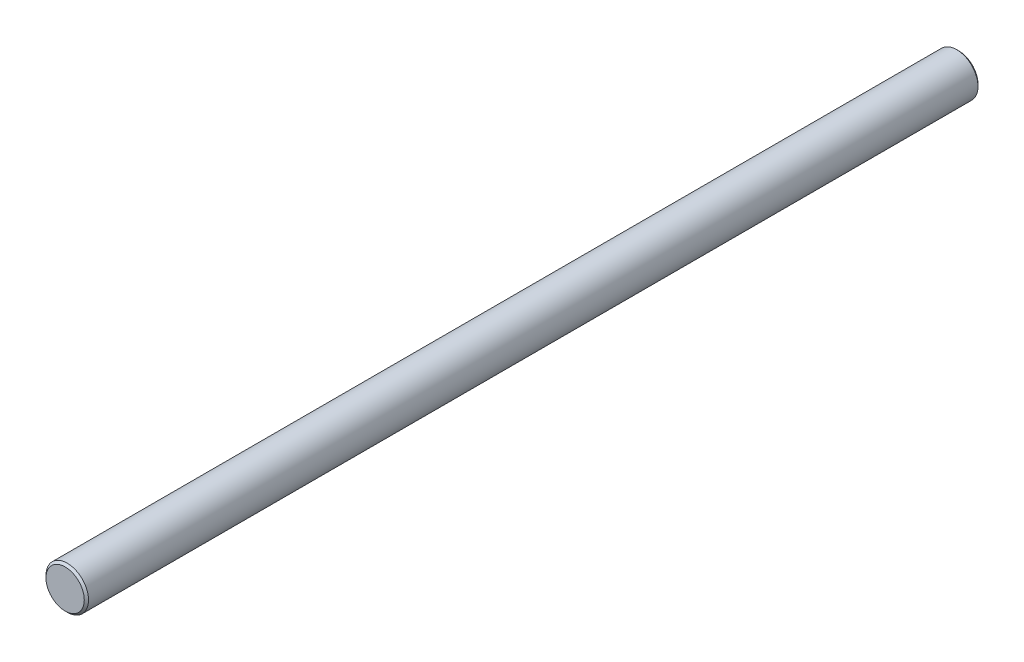
ISO-10303-21;
HEADER;
FILE_DESCRIPTION(('STEP AP214'),'2;1');
FILE_NAME('part.step','',(''),(''),'','','');
FILE_SCHEMA(('AUTOMOTIVE_DESIGN { 1 0 10303 214 1 1 1 1 }'));
ENDSEC;
DATA;
#1=APPLICATION_CONTEXT('core data for automotive mechanical design processes');
#2=APPLICATION_PROTOCOL_DEFINITION('international standard','automotive_design',2000,#1);
#3=PRODUCT_CONTEXT('',#1,'mechanical');
#4=PRODUCT('Part','Part','',(#3));
#5=PRODUCT_RELATED_PRODUCT_CATEGORY('part','',(#4));
#6=PRODUCT_DEFINITION_FORMATION('','',#4);
#7=PRODUCT_DEFINITION_CONTEXT('part definition',#1,'design');
#8=PRODUCT_DEFINITION('design','',#6,#7);
#9=PRODUCT_DEFINITION_SHAPE('','',#8);
#10=(LENGTH_UNIT() NAMED_UNIT(*) SI_UNIT(.MILLI.,.METRE.));
#11=(NAMED_UNIT(*) PLANE_ANGLE_UNIT() SI_UNIT($,.RADIAN.));
#12=(NAMED_UNIT(*) SI_UNIT($,.STERADIAN.) SOLID_ANGLE_UNIT());
#13=UNCERTAINTY_MEASURE_WITH_UNIT(LENGTH_MEASURE(1.E-05),#10,'distance_accuracy_value','');
#14=(GEOMETRIC_REPRESENTATION_CONTEXT(3) GLOBAL_UNCERTAINTY_ASSIGNED_CONTEXT((#13)) GLOBAL_UNIT_ASSIGNED_CONTEXT((#10,
#11,#12)) REPRESENTATION_CONTEXT('',''));
#15=CARTESIAN_POINT('',(0.,0.,0.));
#16=DIRECTION('',(0.,0.,1.));
#17=DIRECTION('',(1.,0.,0.));
#18=AXIS2_PLACEMENT_3D('',#15,#16,#17);
#19=CARTESIAN_POINT('',(0.,0.,-210.));
#20=DIRECTION('',(0.,0.,1.));
#21=DIRECTION('',(1.,0.,0.));
#22=AXIS2_PLACEMENT_3D('',#19,#20,#21);
#23=CYLINDRICAL_SURFACE('',#22,5.);
#24=CARTESIAN_POINT('',(0.,0.,-209.5));
#25=DIRECTION('',(0.,0.,1.));
#26=DIRECTION('',(1.,0.,0.));
#27=AXIS2_PLACEMENT_3D('',#24,#25,#26);
#28=CIRCLE('',#27,5.);
#29=CARTESIAN_POINT('',(5.,0.,-209.5));
#30=VERTEX_POINT('',#29);
#31=EDGE_CURVE('E45',#30,#30,#28,.T.);
#32=ORIENTED_EDGE('',*,*,#31,.T.);
#33=EDGE_LOOP('',(#32));
#34=FACE_BOUND('',#33,.T.);
#35=CARTESIAN_POINT('',(0.,0.,-0.5));
#36=DIRECTION('',(0.,0.,1.));
#37=DIRECTION('',(1.,0.,0.));
#38=AXIS2_PLACEMENT_3D('',#35,#36,#37);
#39=CIRCLE('',#38,5.);
#40=CARTESIAN_POINT('',(5.,0.,-0.5));
#41=VERTEX_POINT('',#40);
#42=EDGE_CURVE('E49',#41,#41,#39,.F.);
#43=ORIENTED_EDGE('',*,*,#42,.T.);
#44=EDGE_LOOP('',(#43));
#45=FACE_BOUND('',#44,.T.);
#46=ADVANCED_FACE('F34',(#34,#45),#23,.T.);
#47=CARTESIAN_POINT('',(0.,0.,-210.));
#48=DIRECTION('',(0.,0.,1.));
#49=DIRECTION('',(1.,0.,0.));
#50=AXIS2_PLACEMENT_3D('',#47,#48,#49);
#51=PLANE('',#50);
#52=CARTESIAN_POINT('',(0.,0.,-210.));
#53=DIRECTION('',(0.,0.,1.));
#54=DIRECTION('',(1.,0.,0.));
#55=AXIS2_PLACEMENT_3D('',#52,#53,#54);
#56=CIRCLE('',#55,4.5);
#57=CARTESIAN_POINT('',(4.5,0.,-210.));
#58=VERTEX_POINT('',#57);
#59=EDGE_CURVE('E41',#58,#58,#56,.F.);
#60=ORIENTED_EDGE('',*,*,#59,.T.);
#61=EDGE_LOOP('',(#60));
#62=FACE_BOUND('',#61,.T.);
#63=ADVANCED_FACE('F65',(#62),#51,.F.);
#64=CARTESIAN_POINT('',(0.,0.,0.));
#65=DIRECTION('',(0.,0.,1.));
#66=DIRECTION('',(1.,0.,0.));
#67=AXIS2_PLACEMENT_3D('',#64,#65,#66);
#68=PLANE('',#67);
#69=CARTESIAN_POINT('',(0.,0.,0.));
#70=DIRECTION('',(0.,0.,1.));
#71=DIRECTION('',(1.,0.,0.));
#72=AXIS2_PLACEMENT_3D('',#69,#70,#71);
#73=CIRCLE('',#72,4.5);
#74=CARTESIAN_POINT('',(4.5,0.,0.));
#75=VERTEX_POINT('',#74);
#76=EDGE_CURVE('E10',#75,#75,#73,.T.);
#77=ORIENTED_EDGE('',*,*,#76,.T.);
#78=EDGE_LOOP('',(#77));
#79=FACE_BOUND('',#78,.T.);
#80=ADVANCED_FACE('F62',(#79),#68,.T.);
#81=CARTESIAN_POINT('',(0.,0.,-209.5));
#82=DIRECTION('',(0.,0.,1.));
#83=DIRECTION('',(1.,0.,0.));
#84=AXIS2_PLACEMENT_3D('',#81,#82,#83);
#85=CONICAL_SURFACE('',#84,5.,0.785398163397472);
#86=ORIENTED_EDGE('',*,*,#59,.F.);
#87=EDGE_LOOP('',(#86));
#88=FACE_BOUND('',#87,.T.);
#89=ORIENTED_EDGE('',*,*,#31,.F.);
#90=EDGE_LOOP('',(#89));
#91=FACE_BOUND('',#90,.T.);
#92=ADVANCED_FACE('F58',(#88,#91),#85,.T.);
#93=CARTESIAN_POINT('',(0.,0.,0.));
#94=DIRECTION('',(0.,0.,-1.));
#95=DIRECTION('',(-1.,0.,0.));
#96=AXIS2_PLACEMENT_3D('',#93,#94,#95);
#97=CONICAL_SURFACE('',#96,4.5,0.785398163397444);
#98=ORIENTED_EDGE('',*,*,#42,.F.);
#99=EDGE_LOOP('',(#98));
#100=FACE_BOUND('',#99,.T.);
#101=ORIENTED_EDGE('',*,*,#76,.F.);
#102=EDGE_LOOP('',(#101));
#103=FACE_BOUND('',#102,.T.);
#104=ADVANCED_FACE('F36',(#100,#103),#97,.T.);
#105=CLOSED_SHELL('',(#46,#63,#80,#92,#104));
#106=MANIFOLD_SOLID_BREP('B2',#105);
#107=ADVANCED_BREP_SHAPE_REPRESENTATION('',(#18,#106),#14);
#108=SHAPE_DEFINITION_REPRESENTATION(#9,#107);
ENDSEC;
END-ISO-10303-21;
